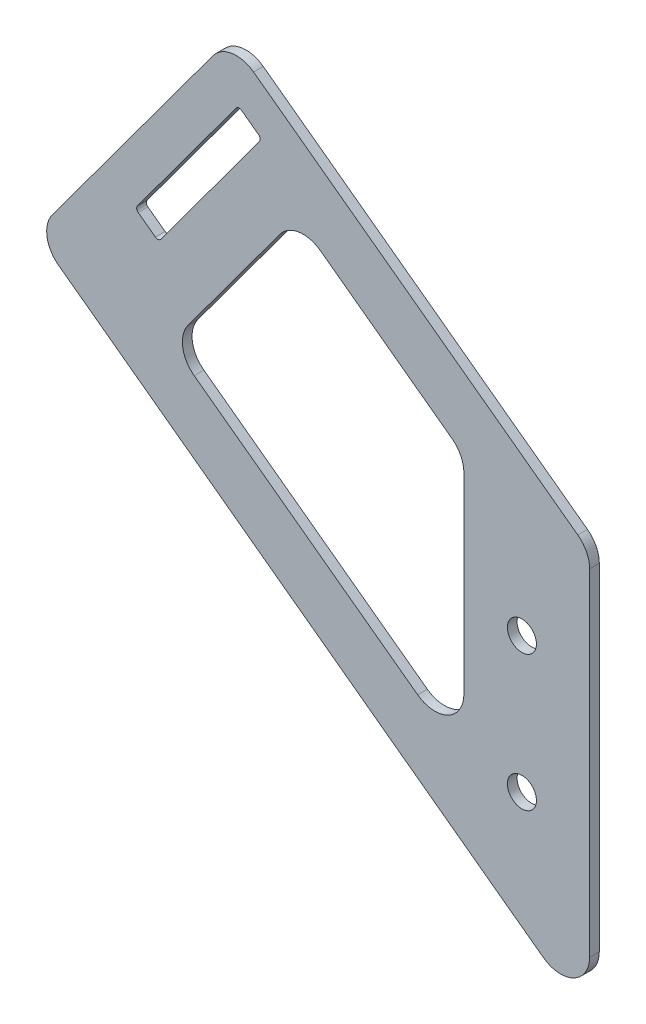
ISO-10303-21;
HEADER;
FILE_DESCRIPTION(('STEP AP214'),'2;1');
FILE_NAME('part.step','',(''),(''),'','','');
FILE_SCHEMA(('AUTOMOTIVE_DESIGN { 1 0 10303 214 1 1 1 1 }'));
ENDSEC;
DATA;
#1=APPLICATION_CONTEXT('core data for automotive mechanical design processes');
#2=APPLICATION_PROTOCOL_DEFINITION('international standard','automotive_design',2000,#1);
#3=PRODUCT_CONTEXT('',#1,'mechanical');
#4=PRODUCT('Part','Part','',(#3));
#5=PRODUCT_RELATED_PRODUCT_CATEGORY('part','',(#4));
#6=PRODUCT_DEFINITION_FORMATION('','',#4);
#7=PRODUCT_DEFINITION_CONTEXT('part definition',#1,'design');
#8=PRODUCT_DEFINITION('design','',#6,#7);
#9=PRODUCT_DEFINITION_SHAPE('','',#8);
#10=(LENGTH_UNIT() NAMED_UNIT(*) SI_UNIT(.MILLI.,.METRE.));
#11=(NAMED_UNIT(*) PLANE_ANGLE_UNIT() SI_UNIT($,.RADIAN.));
#12=(NAMED_UNIT(*) SI_UNIT($,.STERADIAN.) SOLID_ANGLE_UNIT());
#13=UNCERTAINTY_MEASURE_WITH_UNIT(LENGTH_MEASURE(1.E-05),#10,'distance_accuracy_value','');
#14=(GEOMETRIC_REPRESENTATION_CONTEXT(3) GLOBAL_UNCERTAINTY_ASSIGNED_CONTEXT((#13)) GLOBAL_UNIT_ASSIGNED_CONTEXT((#10,
#11,#12)) REPRESENTATION_CONTEXT('',''));
#15=CARTESIAN_POINT('',(0.,0.,0.));
#16=DIRECTION('',(0.,0.,1.));
#17=DIRECTION('',(1.,0.,0.));
#18=AXIS2_PLACEMENT_3D('',#15,#16,#17);
#19=CARTESIAN_POINT('',(136.403656021627,185.179026695265,3.175));
#20=DIRECTION('',(-0.593074905688188,-0.805147288539772,0.));
#21=DIRECTION('',(0.805147288539772,-0.593074905688188,0.));
#22=AXIS2_PLACEMENT_3D('',#19,#20,#21);
#23=PLANE('',#22);
#24=DIRECTION('',(-0.805147288539772,0.593074905688188,0.));
#25=VECTOR('',#24,1.);
#26=CARTESIAN_POINT('',(136.403656021627,185.179026695265,0.));
#27=LINE('',#26,#25);
#28=CARTESIAN_POINT('',(-155.846074694503,400.451417162125,0.));
#29=VERTEX_POINT('',#28);
#30=CARTESIAN_POINT('',(-161.470028504955,404.594045378358,0.));
#31=VERTEX_POINT('',#30);
#32=EDGE_CURVE('E224',#29,#31,#27,.T.);
#33=ORIENTED_EDGE('',*,*,#32,.T.);
#34=DIRECTION('',(0.,0.,-1.));
#35=VECTOR('',#34,1.);
#36=CARTESIAN_POINT('',(-161.470028504955,404.594045378358,3.175));
#37=LINE('',#36,#35);
#38=CARTESIAN_POINT('',(-161.470028504955,404.594045378358,3.175));
#39=VERTEX_POINT('',#38);
#40=EDGE_CURVE('E205',#39,#31,#37,.T.);
#41=ORIENTED_EDGE('',*,*,#40,.F.);
#42=DIRECTION('',(-0.805147288539772,0.593074905688188,0.));
#43=VECTOR('',#42,1.);
#44=CARTESIAN_POINT('',(136.403656021627,185.179026695265,3.175));
#45=LINE('',#44,#43);
#46=CARTESIAN_POINT('',(-155.846074694503,400.451417162125,3.175));
#47=VERTEX_POINT('',#46);
#48=EDGE_CURVE('E212',#47,#39,#45,.T.);
#49=ORIENTED_EDGE('',*,*,#48,.F.);
#50=DIRECTION('',(0.,0.,-1.));
#51=VECTOR('',#50,1.);
#52=CARTESIAN_POINT('',(-155.846074694503,400.451417162125,3.175));
#53=LINE('',#52,#51);
#54=EDGE_CURVE('E342',#47,#29,#53,.T.);
#55=ORIENTED_EDGE('',*,*,#54,.T.);
#56=EDGE_LOOP('',(#33,#41,#49,#55));
#57=FACE_BOUND('',#56,.T.);
#58=ADVANCED_FACE('F38',(#57),#23,.F.);
#59=CARTESIAN_POINT('',(-160.716823374731,405.616582434804,3.175));
#60=DIRECTION('',(0.,0.,-1.));
#61=DIRECTION('',(-1.,0.,0.));
#62=AXIS2_PLACEMENT_3D('',#59,#60,#61);
#63=CYLINDRICAL_SURFACE('',#62,1.27000000000001);
#64=CARTESIAN_POINT('',(-160.716823374731,405.616582434804,0.));
#65=DIRECTION('',(0.,0.,1.));
#66=DIRECTION('',(1.,0.,0.));
#67=AXIS2_PLACEMENT_3D('',#64,#65,#66);
#68=CIRCLE('',#67,1.27000000000001);
#69=CARTESIAN_POINT('',(-161.739360431176,406.369787565028,0.));
#70=VERTEX_POINT('',#69);
#71=EDGE_CURVE('E367',#31,#70,#68,.F.);
#72=ORIENTED_EDGE('',*,*,#71,.T.);
#73=DIRECTION('',(0.,0.,-1.));
#74=VECTOR('',#73,1.);
#75=CARTESIAN_POINT('',(-161.739360431176,406.369787565028,3.175));
#76=LINE('',#75,#74);
#77=CARTESIAN_POINT('',(-161.739360431176,406.369787565028,3.175));
#78=VERTEX_POINT('',#77);
#79=EDGE_CURVE('E207',#78,#70,#76,.T.);
#80=ORIENTED_EDGE('',*,*,#79,.F.);
#81=CARTESIAN_POINT('',(-160.716823374731,405.616582434804,3.175));
#82=DIRECTION('',(0.,0.,1.));
#83=DIRECTION('',(1.,0.,0.));
#84=AXIS2_PLACEMENT_3D('',#81,#82,#83);
#85=CIRCLE('',#84,1.27000000000001);
#86=EDGE_CURVE('E200',#39,#78,#85,.F.);
#87=ORIENTED_EDGE('',*,*,#86,.F.);
#88=ORIENTED_EDGE('',*,*,#40,.T.);
#89=EDGE_LOOP('',(#72,#80,#87,#88));
#90=FACE_BOUND('',#89,.T.);
#91=ADVANCED_FACE('F203',(#90),#63,.F.);
#92=CARTESIAN_POINT('',(-298.896221583027,220.168223813321,3.175));
#93=DIRECTION('',(0.805147288539767,-0.593074905688195,0.));
#94=DIRECTION('',(0.593074905688195,0.805147288539767,0.));
#95=AXIS2_PLACEMENT_3D('',#92,#93,#94);
#96=PLANE('',#95);
#97=DIRECTION('',(-0.593074905688195,-0.805147288539767,0.));
#98=VECTOR('',#97,1.);
#99=CARTESIAN_POINT('',(-298.896221583027,220.168223813321,0.));
#100=LINE('',#99,#98);
#101=CARTESIAN_POINT('',(-129.351539831544,450.338880992184,0.));
#102=VERTEX_POINT('',#101);
#103=EDGE_CURVE('E369',#102,#70,#100,.T.);
#104=ORIENTED_EDGE('',*,*,#103,.F.);
#105=DIRECTION('',(0.,0.,-1.));
#106=VECTOR('',#105,1.);
#107=CARTESIAN_POINT('',(-129.351539831544,450.338880992184,3.175));
#108=LINE('',#107,#106);
#109=CARTESIAN_POINT('',(-129.351539831544,450.338880992184,3.175));
#110=VERTEX_POINT('',#109);
#111=EDGE_CURVE('E229',#110,#102,#108,.T.);
#112=ORIENTED_EDGE('',*,*,#111,.F.);
#113=DIRECTION('',(-0.593074905688195,-0.805147288539767,0.));
#114=VECTOR('',#113,1.);
#115=CARTESIAN_POINT('',(-298.896221583027,220.168223813321,3.175));
#116=LINE('',#115,#114);
#117=EDGE_CURVE('E211',#110,#78,#116,.T.);
#118=ORIENTED_EDGE('',*,*,#117,.T.);
#119=ORIENTED_EDGE('',*,*,#79,.T.);
#120=EDGE_LOOP('',(#104,#112,#118,#119));
#121=FACE_BOUND('',#120,.T.);
#122=ADVANCED_FACE('F405',(#121),#96,.T.);
#123=CARTESIAN_POINT('',(-128.329002775098,449.58567586196,3.175));
#124=DIRECTION('',(0.,0.,-1.));
#125=DIRECTION('',(-1.,0.,0.));
#126=AXIS2_PLACEMENT_3D('',#123,#124,#125);
#127=CYLINDRICAL_SURFACE('',#126,1.27000000000003);
#128=CARTESIAN_POINT('',(-128.329002775098,449.58567586196,0.));
#129=DIRECTION('',(0.,0.,1.));
#130=DIRECTION('',(1.,0.,0.));
#131=AXIS2_PLACEMENT_3D('',#128,#129,#130);
#132=CIRCLE('',#131,1.27000000000003);
#133=CARTESIAN_POINT('',(-127.575797644874,450.608212918406,0.));
#134=VERTEX_POINT('',#133);
#135=EDGE_CURVE('E372',#102,#134,#132,.F.);
#136=ORIENTED_EDGE('',*,*,#135,.T.);
#137=DIRECTION('',(0.,0.,-1.));
#138=VECTOR('',#137,1.);
#139=CARTESIAN_POINT('',(-127.575797644874,450.608212918406,3.175));
#140=LINE('',#139,#138);
#141=CARTESIAN_POINT('',(-127.575797644874,450.608212918406,3.175));
#142=VERTEX_POINT('',#141);
#143=EDGE_CURVE('E395',#142,#134,#140,.T.);
#144=ORIENTED_EDGE('',*,*,#143,.F.);
#145=CARTESIAN_POINT('',(-128.329002775098,449.58567586196,3.175));
#146=DIRECTION('',(0.,0.,1.));
#147=DIRECTION('',(1.,0.,0.));
#148=AXIS2_PLACEMENT_3D('',#145,#146,#147);
#149=CIRCLE('',#148,1.27000000000003);
#150=EDGE_CURVE('E331',#110,#142,#149,.F.);
#151=ORIENTED_EDGE('',*,*,#150,.F.);
#152=ORIENTED_EDGE('',*,*,#111,.T.);
#153=EDGE_LOOP('',(#136,#144,#151,#152));
#154=FACE_BOUND('',#153,.T.);
#155=ADVANCED_FACE('F399',(#154),#127,.F.);
#156=CARTESIAN_POINT('',(170.297886881707,231.193194235311,3.175));
#157=DIRECTION('',(-0.593074905688191,-0.805147288539769,0.));
#158=DIRECTION('',(0.805147288539769,-0.593074905688191,0.));
#159=AXIS2_PLACEMENT_3D('',#156,#157,#158);
#160=PLANE('',#159);
#161=DIRECTION('',(-0.80514728853977,0.593074905688192,0.));
#162=VECTOR('',#161,1.);
#163=CARTESIAN_POINT('',(170.297886881707,231.193194235311,0.));
#164=LINE('',#163,#162);
#165=CARTESIAN_POINT('',(-121.951843834423,446.465584702173,0.));
#166=VERTEX_POINT('',#165);
#167=EDGE_CURVE('E375',#166,#134,#164,.T.);
#168=ORIENTED_EDGE('',*,*,#167,.F.);
#169=DIRECTION('',(0.,0.,-1.));
#170=VECTOR('',#169,1.);
#171=CARTESIAN_POINT('',(-121.951843834423,446.465584702173,3.175));
#172=LINE('',#171,#170);
#173=CARTESIAN_POINT('',(-121.951843834423,446.465584702173,3.175));
#174=VERTEX_POINT('',#173);
#175=EDGE_CURVE('E393',#174,#166,#172,.T.);
#176=ORIENTED_EDGE('',*,*,#175,.F.);
#177=DIRECTION('',(-0.80514728853977,0.593074905688192,0.));
#178=VECTOR('',#177,1.);
#179=CARTESIAN_POINT('',(170.297886881707,231.193194235311,3.175));
#180=LINE('',#179,#178);
#181=EDGE_CURVE('E333',#174,#142,#180,.T.);
#182=ORIENTED_EDGE('',*,*,#181,.T.);
#183=ORIENTED_EDGE('',*,*,#143,.T.);
#184=EDGE_LOOP('',(#168,#176,#182,#183));
#185=FACE_BOUND('',#184,.T.);
#186=ADVANCED_FACE('F415',(#185),#160,.T.);
#187=CARTESIAN_POINT('',(-122.705048964647,445.443047645728,3.175));
#188=DIRECTION('',(0.,0.,-1.));
#189=DIRECTION('',(-1.,0.,0.));
#190=AXIS2_PLACEMENT_3D('',#187,#188,#189);
#191=CYLINDRICAL_SURFACE('',#190,1.27000000000002);
#192=CARTESIAN_POINT('',(-122.705048964647,445.443047645728,0.));
#193=DIRECTION('',(0.,0.,1.));
#194=DIRECTION('',(1.,0.,0.));
#195=AXIS2_PLACEMENT_3D('',#192,#193,#194);
#196=CIRCLE('',#195,1.27000000000002);
#197=CARTESIAN_POINT('',(-121.682511908201,444.689842515503,0.));
#198=VERTEX_POINT('',#197);
#199=EDGE_CURVE('E378',#166,#198,#196,.F.);
#200=ORIENTED_EDGE('',*,*,#199,.T.);
#201=DIRECTION('',(0.,0.,-1.));
#202=VECTOR('',#201,1.);
#203=CARTESIAN_POINT('',(-121.682511908201,444.689842515503,3.175));
#204=LINE('',#203,#202);
#205=CARTESIAN_POINT('',(-121.682511908201,444.689842515503,3.175));
#206=VERTEX_POINT('',#205);
#207=EDGE_CURVE('E391',#206,#198,#204,.T.);
#208=ORIENTED_EDGE('',*,*,#207,.F.);
#209=CARTESIAN_POINT('',(-122.705048964647,445.443047645728,3.175));
#210=DIRECTION('',(0.,0.,1.));
#211=DIRECTION('',(1.,0.,0.));
#212=AXIS2_PLACEMENT_3D('',#209,#210,#211);
#213=CIRCLE('',#212,1.27000000000002);
#214=EDGE_CURVE('E336',#174,#206,#213,.F.);
#215=ORIENTED_EDGE('',*,*,#214,.F.);
#216=ORIENTED_EDGE('',*,*,#175,.T.);
#217=EDGE_LOOP('',(#200,#208,#215,#216));
#218=FACE_BOUND('',#217,.T.);
#219=ADVANCED_FACE('F418',(#218),#191,.F.);
#220=CARTESIAN_POINT('',(-291.227193659685,214.51918533664,3.175));
#221=DIRECTION('',(-0.805147288539766,0.593074905688196,0.));
#222=DIRECTION('',(-0.593074905688196,-0.805147288539766,0.));
#223=AXIS2_PLACEMENT_3D('',#220,#221,#222);
#224=PLANE('',#223);
#225=DIRECTION('',(0.593074905688196,0.805147288539766,0.));
#226=VECTOR('',#225,1.);
#227=CARTESIAN_POINT('',(-291.227193659685,214.51918533664,0.));
#228=LINE('',#227,#226);
#229=CARTESIAN_POINT('',(-154.070332507834,400.720749088347,0.));
#230=VERTEX_POINT('',#229);
#231=EDGE_CURVE('E381',#230,#198,#228,.T.);
#232=ORIENTED_EDGE('',*,*,#231,.F.);
#233=DIRECTION('',(0.,0.,-1.));
#234=VECTOR('',#233,1.);
#235=CARTESIAN_POINT('',(-154.070332507834,400.720749088347,3.175));
#236=LINE('',#235,#234);
#237=CARTESIAN_POINT('',(-154.070332507834,400.720749088347,3.175));
#238=VERTEX_POINT('',#237);
#239=EDGE_CURVE('E389',#238,#230,#236,.T.);
#240=ORIENTED_EDGE('',*,*,#239,.F.);
#241=DIRECTION('',(0.593074905688196,0.805147288539766,0.));
#242=VECTOR('',#241,1.);
#243=CARTESIAN_POINT('',(-291.227193659685,214.51918533664,3.175));
#244=LINE('',#243,#242);
#245=EDGE_CURVE('E338',#238,#206,#244,.T.);
#246=ORIENTED_EDGE('',*,*,#245,.T.);
#247=ORIENTED_EDGE('',*,*,#207,.T.);
#248=EDGE_LOOP('',(#232,#240,#246,#247));
#249=FACE_BOUND('',#248,.T.);
#250=ADVANCED_FACE('F411',(#249),#224,.T.);
#251=CARTESIAN_POINT('',(-54.6100000000139,0.,3.175));
#252=DIRECTION('',(1.,0.,0.));
#253=DIRECTION('',(0.,1.,0.));
#254=AXIS2_PLACEMENT_3D('',#251,#252,#253);
#255=PLANE('',#254);
#256=DIRECTION('',(0.,-1.,0.));
#257=VECTOR('',#256,1.);
#258=CARTESIAN_POINT('',(-54.6100000000139,0.,0.));
#259=LINE('',#258,#257);
#260=CARTESIAN_POINT('',(-54.6100000000139,384.160563101391,0.));
#261=VERTEX_POINT('',#260);
#262=CARTESIAN_POINT('',(-54.6100000000139,321.066517175791,0.));
#263=VERTEX_POINT('',#262);
#264=EDGE_CURVE('E360',#261,#263,#259,.T.);
#265=ORIENTED_EDGE('',*,*,#264,.T.);
#266=DIRECTION('',(0.,0.,-1.));
#267=VECTOR('',#266,1.);
#268=CARTESIAN_POINT('',(-54.6100000000139,321.066517175791,3.175));
#269=LINE('',#268,#267);
#270=CARTESIAN_POINT('',(-54.6100000000139,321.066517175791,3.175));
#271=VERTEX_POINT('',#270);
#272=EDGE_CURVE('E243',#263,#271,#269,.F.);
#273=ORIENTED_EDGE('',*,*,#272,.T.);
#274=DIRECTION('',(0.,-1.,0.));
#275=VECTOR('',#274,1.);
#276=CARTESIAN_POINT('',(-54.6100000000139,0.,3.175));
#277=LINE('',#276,#275);
#278=CARTESIAN_POINT('',(-54.6100000000139,384.160563101391,3.175));
#279=VERTEX_POINT('',#278);
#280=EDGE_CURVE('E519',#279,#271,#277,.T.);
#281=ORIENTED_EDGE('',*,*,#280,.F.);
#282=DIRECTION('',(0.,0.,-1.));
#283=VECTOR('',#282,1.);
#284=CARTESIAN_POINT('',(-54.6100000000139,384.160563101391,0.));
#285=LINE('',#284,#283);
#286=EDGE_CURVE('E240',#279,#261,#285,.T.);
#287=ORIENTED_EDGE('',*,*,#286,.T.);
#288=EDGE_LOOP('',(#265,#273,#281,#287));
#289=FACE_BOUND('',#288,.T.);
#290=ADVANCED_FACE('F425',(#289),#255,.F.);
#291=CARTESIAN_POINT('',(125.105579068267,169.840970848579,3.175));
#292=DIRECTION('',(-0.593074905688196,-0.805147288539766,0.));
#293=DIRECTION('',(0.805147288539766,-0.593074905688196,0.));
#294=AXIS2_PLACEMENT_3D('',#291,#292,#293);
#295=PLANE('',#294);
#296=DIRECTION('',(-0.805147288539766,0.593074905688196,0.));
#297=VECTOR('',#296,1.);
#298=CARTESIAN_POINT('',(125.105579068267,169.840970848579,0.));
#299=LINE('',#298,#297);
#300=CARTESIAN_POINT('',(-69.784038476694,313.39748925245,0.));
#301=VERTEX_POINT('',#300);
#302=CARTESIAN_POINT('',(-143.114530821394,367.413040755179,0.));
#303=VERTEX_POINT('',#302);
#304=EDGE_CURVE('E313',#301,#303,#299,.T.);
#305=ORIENTED_EDGE('',*,*,#304,.T.);
#306=DIRECTION('',(0.,0.,-1.));
#307=VECTOR('',#306,1.);
#308=CARTESIAN_POINT('',(-143.114530821394,367.413040755179,3.175));
#309=LINE('',#308,#307);
#310=CARTESIAN_POINT('',(-143.114530821394,367.413040755179,3.175));
#311=VERTEX_POINT('',#310);
#312=EDGE_CURVE('E238',#303,#311,#309,.F.);
#313=ORIENTED_EDGE('',*,*,#312,.T.);
#314=DIRECTION('',(-0.805147288539766,0.593074905688196,0.));
#315=VECTOR('',#314,1.);
#316=CARTESIAN_POINT('',(125.105579068267,169.840970848579,3.175));
#317=LINE('',#316,#315);
#318=CARTESIAN_POINT('',(-69.784038476694,313.39748925245,3.175));
#319=VERTEX_POINT('',#318);
#320=EDGE_CURVE('E326',#319,#311,#317,.T.);
#321=ORIENTED_EDGE('',*,*,#320,.F.);
#322=DIRECTION('',(0.,0.,-1.));
#323=VECTOR('',#322,1.);
#324=CARTESIAN_POINT('',(-69.784038476694,313.39748925245,0.));
#325=LINE('',#324,#323);
#326=EDGE_CURVE('E235',#319,#301,#325,.T.);
#327=ORIENTED_EDGE('',*,*,#326,.T.);
#328=EDGE_LOOP('',(#305,#313,#321,#327));
#329=FACE_BOUND('',#328,.T.);
#330=ADVANCED_FACE('F443',(#329),#295,.F.);
#331=CARTESIAN_POINT('',(-275.889137813002,203.22110838328,3.175));
#332=DIRECTION('',(0.805147288539766,-0.593074905688195,0.));
#333=DIRECTION('',(0.593074905688196,0.805147288539767,0.));
#334=AXIS2_PLACEMENT_3D('',#331,#332,#333);
#335=PLANE('',#334);
#336=DIRECTION('',(-0.593074905688196,-0.805147288539767,0.));
#337=VECTOR('',#336,1.);
#338=CARTESIAN_POINT('',(-275.889137813002,203.22110838328,3.175));
#339=LINE('',#338,#337);
#340=CARTESIAN_POINT('',(-115.006315059095,421.63258941302,3.175));
#341=VERTEX_POINT('',#340);
#342=CARTESIAN_POINT('',(-145.134520268055,380.7311071552,3.175));
#343=VERTEX_POINT('',#342);
#344=EDGE_CURVE('E321',#341,#343,#339,.T.);
#345=ORIENTED_EDGE('',*,*,#344,.T.);
#346=DIRECTION('',(0.,0.,-1.));
#347=VECTOR('',#346,1.);
#348=CARTESIAN_POINT('',(-145.134520268055,380.7311071552,3.175));
#349=LINE('',#348,#347);
#350=CARTESIAN_POINT('',(-145.134520268055,380.7311071552,0.));
#351=VERTEX_POINT('',#350);
#352=EDGE_CURVE('E227',#343,#351,#349,.T.);
#353=ORIENTED_EDGE('',*,*,#352,.T.);
#354=DIRECTION('',(-0.593074905688196,-0.805147288539767,0.));
#355=VECTOR('',#354,1.);
#356=CARTESIAN_POINT('',(-275.889137813002,203.22110838328,0.));
#357=LINE('',#356,#355);
#358=CARTESIAN_POINT('',(-115.006315059095,421.63258941302,0.));
#359=VERTEX_POINT('',#358);
#360=EDGE_CURVE('E302',#359,#351,#357,.T.);
#361=ORIENTED_EDGE('',*,*,#360,.F.);
#362=DIRECTION('',(0.,0.,-1.));
#363=VECTOR('',#362,1.);
#364=CARTESIAN_POINT('',(-115.006315059095,421.63258941302,3.175));
#365=LINE('',#364,#363);
#366=EDGE_CURVE('E225',#359,#341,#365,.F.);
#367=ORIENTED_EDGE('',*,*,#366,.T.);
#368=EDGE_LOOP('',(#345,#353,#361,#367));
#369=FACE_BOUND('',#368,.T.);
#370=ADVANCED_FACE('F310',(#369),#335,.T.);
#371=CARTESIAN_POINT('',(-309.121592147482,227.700275115561,3.175));
#372=DIRECTION('',(0.805147288539767,-0.593074905688195,0.));
#373=DIRECTION('',(0.593074905688195,0.805147288539767,0.));
#374=AXIS2_PLACEMENT_3D('',#371,#372,#373);
#375=PLANE('',#374);
#376=DIRECTION('',(-0.593074905688195,-0.805147288539767,0.));
#377=VECTOR('',#376,1.);
#378=CARTESIAN_POINT('',(-309.121592147482,227.700275115561,3.175));
#379=LINE('',#378,#377);
#380=CARTESIAN_POINT('',(-136.940692440215,461.449811991984,3.175));
#381=VERTEX_POINT('',#380);
#382=CARTESIAN_POINT('',(-189.665051555895,389.872218040798,3.175));
#383=VERTEX_POINT('',#382);
#384=EDGE_CURVE('E503',#381,#383,#379,.T.);
#385=ORIENTED_EDGE('',*,*,#384,.F.);
#386=DIRECTION('',(0.,0.,-1.));
#387=VECTOR('',#386,1.);
#388=CARTESIAN_POINT('',(-136.940692440215,461.449811991984,3.175));
#389=LINE('',#388,#387);
#390=CARTESIAN_POINT('',(-136.940692440215,461.449811991984,0.));
#391=VERTEX_POINT('',#390);
#392=EDGE_CURVE('E281',#381,#391,#389,.T.);
#393=ORIENTED_EDGE('',*,*,#392,.T.);
#394=DIRECTION('',(-0.593074905688195,-0.805147288539767,0.));
#395=VECTOR('',#394,1.);
#396=CARTESIAN_POINT('',(-309.121592147482,227.700275115561,0.));
#397=LINE('',#396,#395);
#398=CARTESIAN_POINT('',(-189.665051555895,389.872218040798,0.));
#399=VERTEX_POINT('',#398);
#400=EDGE_CURVE('E349',#391,#399,#397,.T.);
#401=ORIENTED_EDGE('',*,*,#400,.T.);
#402=DIRECTION('',(0.,0.,-1.));
#403=VECTOR('',#402,1.);
#404=CARTESIAN_POINT('',(-189.665051555895,389.872218040798,3.175));
#405=LINE('',#404,#403);
#406=EDGE_CURVE('E279',#399,#383,#405,.F.);
#407=ORIENTED_EDGE('',*,*,#406,.T.);
#408=EDGE_LOOP('',(#385,#393,#401,#407));
#409=FACE_BOUND('',#408,.T.);
#410=ADVANCED_FACE('F442',(#409),#375,.F.);
#411=CARTESIAN_POINT('',(113.807502114907,154.502915001896,3.175));
#412=DIRECTION('',(0.593074905688195,0.805147288539767,0.));
#413=DIRECTION('',(-0.805147288539767,0.593074905688195,0.));
#414=AXIS2_PLACEMENT_3D('',#411,#412,#413);
#415=PLANE('',#414);
#416=DIRECTION('',(0.805147288539767,-0.593074905688195,0.));
#417=VECTOR('',#416,1.);
#418=CARTESIAN_POINT('',(113.807502114907,154.502915001896,0.));
#419=LINE('',#418,#417);
#420=CARTESIAN_POINT('',(-187.645062109234,376.554151640777,0.));
#421=VERTEX_POINT('',#420);
#422=CARTESIAN_POINT('',(-28.5090384766937,259.333882069191,0.));
#423=VERTEX_POINT('',#422);
#424=EDGE_CURVE('E352',#421,#423,#419,.T.);
#425=ORIENTED_EDGE('',*,*,#424,.T.);
#426=DIRECTION('',(0.,0.,-1.));
#427=VECTOR('',#426,1.);
#428=CARTESIAN_POINT('',(-28.5090384766937,259.333882069191,3.175));
#429=LINE('',#428,#427);
#430=CARTESIAN_POINT('',(-28.5090384766937,259.333882069191,3.175));
#431=VERTEX_POINT('',#430);
#432=EDGE_CURVE('E266',#423,#431,#429,.F.);
#433=ORIENTED_EDGE('',*,*,#432,.T.);
#434=DIRECTION('',(0.805147288539767,-0.593074905688195,0.));
#435=VECTOR('',#434,1.);
#436=CARTESIAN_POINT('',(113.807502114907,154.502915001896,3.175));
#437=LINE('',#436,#435);
#438=CARTESIAN_POINT('',(-187.645062109234,376.554151640777,3.175));
#439=VERTEX_POINT('',#438);
#440=EDGE_CURVE('E508',#439,#431,#437,.T.);
#441=ORIENTED_EDGE('',*,*,#440,.F.);
#442=DIRECTION('',(0.,0.,-1.));
#443=VECTOR('',#442,1.);
#444=CARTESIAN_POINT('',(-187.645062109234,376.554151640777,3.175));
#445=LINE('',#444,#443);
#446=EDGE_CURVE('E263',#439,#421,#445,.T.);
#447=ORIENTED_EDGE('',*,*,#446,.T.);
#448=EDGE_LOOP('',(#425,#433,#441,#447));
#449=FACE_BOUND('',#448,.T.);
#450=ADVANCED_FACE('F455',(#449),#415,.F.);
#451=CARTESIAN_POINT('',(-13.3350000000136,0.,3.175));
#452=DIRECTION('',(-1.,0.,0.));
#453=DIRECTION('',(0.,0.,1.));
#454=AXIS2_PLACEMENT_3D('',#451,#452,#453);
#455=PLANE('',#454);
#456=DIRECTION('',(0.,1.,0.));
#457=VECTOR('',#456,1.);
#458=CARTESIAN_POINT('',(-13.3350000000136,0.,3.175));
#459=LINE('',#458,#457);
#460=CARTESIAN_POINT('',(-13.3350000000136,267.002909992532,3.175));
#461=VERTEX_POINT('',#460);
#462=CARTESIAN_POINT('',(-13.3350000000136,377.417490362331,3.175));
#463=VERTEX_POINT('',#462);
#464=EDGE_CURVE('E511',#461,#463,#459,.T.);
#465=ORIENTED_EDGE('',*,*,#464,.F.);
#466=DIRECTION('',(0.,0.,-1.));
#467=VECTOR('',#466,1.);
#468=CARTESIAN_POINT('',(-13.3350000000136,267.002909992532,3.175));
#469=LINE('',#468,#467);
#470=CARTESIAN_POINT('',(-13.3350000000136,267.002909992532,0.));
#471=VERTEX_POINT('',#470);
#472=EDGE_CURVE('E252',#461,#471,#469,.T.);
#473=ORIENTED_EDGE('',*,*,#472,.T.);
#474=DIRECTION('',(0.,1.,0.));
#475=VECTOR('',#474,1.);
#476=CARTESIAN_POINT('',(-13.3350000000136,0.,0.));
#477=LINE('',#476,#475);
#478=CARTESIAN_POINT('',(-13.3350000000136,377.417490362331,0.));
#479=VERTEX_POINT('',#478);
#480=EDGE_CURVE('E355',#471,#479,#477,.T.);
#481=ORIENTED_EDGE('',*,*,#480,.T.);
#482=DIRECTION('',(0.,0.,-1.));
#483=VECTOR('',#482,1.);
#484=CARTESIAN_POINT('',(-13.3350000000136,377.417490362331,3.175));
#485=LINE('',#484,#483);
#486=EDGE_CURVE('E250',#479,#463,#485,.F.);
#487=ORIENTED_EDGE('',*,*,#486,.T.);
#488=EDGE_LOOP('',(#465,#473,#481,#487));
#489=FACE_BOUND('',#488,.T.);
#490=ADVANCED_FACE('F439',(#489),#455,.F.);
#491=CARTESIAN_POINT('',(166.531861230587,226.080508953081,3.175));
#492=DIRECTION('',(0.593074905688196,0.805147288539766,0.));
#493=DIRECTION('',(-0.805147288539766,0.593074905688196,0.));
#494=AXIS2_PLACEMENT_3D('',#491,#492,#493);
#495=PLANE('',#494);
#496=DIRECTION('',(0.805147288539766,-0.593074905688196,0.));
#497=VECTOR('',#496,1.);
#498=CARTESIAN_POINT('',(166.531861230587,226.080508953081,0.));
#499=LINE('',#498,#497);
#500=CARTESIAN_POINT('',(-101.688248659074,423.652578859681,0.));
#501=VERTEX_POINT('',#500);
#502=CARTESIAN_POINT('',(-58.4859615233339,391.829591024732,0.));
#503=VERTEX_POINT('',#502);
#504=EDGE_CURVE('E304',#501,#503,#499,.T.);
#505=ORIENTED_EDGE('',*,*,#504,.T.);
#506=DIRECTION('',(0.,0.,-1.));
#507=VECTOR('',#506,1.);
#508=CARTESIAN_POINT('',(-58.4859615233339,391.829591024732,3.175));
#509=LINE('',#508,#507);
#510=CARTESIAN_POINT('',(-58.4859615233339,391.829591024732,3.175));
#511=VERTEX_POINT('',#510);
#512=EDGE_CURVE('E248',#503,#511,#509,.F.);
#513=ORIENTED_EDGE('',*,*,#512,.T.);
#514=DIRECTION('',(0.805147288539766,-0.593074905688196,0.));
#515=VECTOR('',#514,1.);
#516=CARTESIAN_POINT('',(166.531861230587,226.080508953081,3.175));
#517=LINE('',#516,#515);
#518=CARTESIAN_POINT('',(-101.688248659074,423.652578859681,3.175));
#519=VERTEX_POINT('',#518);
#520=EDGE_CURVE('E221',#519,#511,#517,.T.);
#521=ORIENTED_EDGE('',*,*,#520,.F.);
#522=DIRECTION('',(0.,0.,-1.));
#523=VECTOR('',#522,1.);
#524=CARTESIAN_POINT('',(-101.688248659074,423.652578859681,3.175));
#525=LINE('',#524,#523);
#526=EDGE_CURVE('E245',#519,#501,#525,.T.);
#527=ORIENTED_EDGE('',*,*,#526,.T.);
#528=EDGE_LOOP('',(#505,#513,#521,#527));
#529=FACE_BOUND('',#528,.T.);
#530=ADVANCED_FACE('F323',(#529),#495,.F.);
#531=CARTESIAN_POINT('',(177.829938183947,241.418564799764,3.175));
#532=DIRECTION('',(-0.593074905688196,-0.805147288539766,0.));
#533=DIRECTION('',(0.805147288539767,-0.593074905688196,0.));
#534=AXIS2_PLACEMENT_3D('',#531,#532,#533);
#535=PLANE('',#534);
#536=DIRECTION('',(-0.805147288539766,0.593074905688196,0.));
#537=VECTOR('',#536,1.);
#538=CARTESIAN_POINT('',(177.829938183947,241.418564799764,3.175));
#539=LINE('',#538,#537);
#540=CARTESIAN_POINT('',(-17.2109615233336,385.086518285673,3.175));
#541=VERTEX_POINT('',#540);
#542=CARTESIAN_POINT('',(-123.622626040193,463.469801438645,3.175));
#543=VERTEX_POINT('',#542);
#544=EDGE_CURVE('E505',#541,#543,#539,.T.);
#545=ORIENTED_EDGE('',*,*,#544,.F.);
#546=DIRECTION('',(0.,0.,-1.));
#547=VECTOR('',#546,1.);
#548=CARTESIAN_POINT('',(-17.2109615233336,385.086518285673,3.175));
#549=LINE('',#548,#547);
#550=CARTESIAN_POINT('',(-17.2109615233336,385.086518285673,0.));
#551=VERTEX_POINT('',#550);
#552=EDGE_CURVE('E276',#541,#551,#549,.T.);
#553=ORIENTED_EDGE('',*,*,#552,.T.);
#554=DIRECTION('',(-0.805147288539766,0.593074905688196,0.));
#555=VECTOR('',#554,1.);
#556=CARTESIAN_POINT('',(177.829938183947,241.418564799764,0.));
#557=LINE('',#556,#555);
#558=CARTESIAN_POINT('',(-123.622626040193,463.469801438645,0.));
#559=VERTEX_POINT('',#558);
#560=EDGE_CURVE('E358',#551,#559,#557,.T.);
#561=ORIENTED_EDGE('',*,*,#560,.T.);
#562=DIRECTION('',(0.,0.,-1.));
#563=VECTOR('',#562,1.);
#564=CARTESIAN_POINT('',(-123.622626040193,463.469801438645,3.175));
#565=LINE('',#564,#563);
#566=EDGE_CURVE('E53',#559,#543,#565,.F.);
#567=ORIENTED_EDGE('',*,*,#566,.T.);
#568=EDGE_LOOP('',(#545,#553,#561,#567));
#569=FACE_BOUND('',#568,.T.);
#570=ADVANCED_FACE('F438',(#569),#535,.F.);
#571=CARTESIAN_POINT('',(-35.5600000000141,302.837639338074,3.175));
#572=DIRECTION('',(0.,0.,-1.));
#573=DIRECTION('',(-1.,0.,0.));
#574=AXIS2_PLACEMENT_3D('',#571,#572,#573);
#575=CYLINDRICAL_SURFACE('',#574,4.7625000000168);
#576=CARTESIAN_POINT('',(-35.5600000000141,302.837639338074,3.175));
#577=DIRECTION('',(0.,0.,1.));
#578=DIRECTION('',(1.,0.,0.));
#579=AXIS2_PLACEMENT_3D('',#576,#577,#578);
#580=CIRCLE('',#579,4.7625000000168);
#581=CARTESIAN_POINT('',(-30.7974999999973,302.837639338074,3.175));
#582=VERTEX_POINT('',#581);
#583=EDGE_CURVE('E509',#582,#582,#580,.T.);
#584=ORIENTED_EDGE('',*,*,#583,.T.);
#585=EDGE_LOOP('',(#584));
#586=FACE_BOUND('',#585,.T.);
#587=CARTESIAN_POINT('',(-35.5600000000141,302.837639338074,0.));
#588=DIRECTION('',(0.,0.,1.));
#589=DIRECTION('',(1.,0.,0.));
#590=AXIS2_PLACEMENT_3D('',#587,#588,#589);
#591=CIRCLE('',#590,4.7625000000168);
#592=CARTESIAN_POINT('',(-30.7974999999973,302.837639338074,0.));
#593=VERTEX_POINT('',#592);
#594=EDGE_CURVE('E346',#593,#593,#591,.T.);
#595=ORIENTED_EDGE('',*,*,#594,.F.);
#596=EDGE_LOOP('',(#595));
#597=FACE_BOUND('',#596,.T.);
#598=ADVANCED_FACE('F452',(#586,#597),#575,.F.);
#599=CARTESIAN_POINT('',(-35.5600000000139,347.287639338074,3.175));
#600=DIRECTION('',(0.,0.,-1.));
#601=DIRECTION('',(-1.,0.,0.));
#602=AXIS2_PLACEMENT_3D('',#599,#600,#601);
#603=CYLINDRICAL_SURFACE('',#602,4.76250000001677);
#604=CARTESIAN_POINT('',(-35.5600000000139,347.287639338074,3.175));
#605=DIRECTION('',(0.,0.,1.));
#606=DIRECTION('',(1.,0.,0.));
#607=AXIS2_PLACEMENT_3D('',#604,#605,#606);
#608=CIRCLE('',#607,4.76250000001677);
#609=CARTESIAN_POINT('',(-30.7974999999972,347.287639338074,3.175));
#610=VERTEX_POINT('',#609);
#611=EDGE_CURVE('E387',#610,#610,#608,.T.);
#612=ORIENTED_EDGE('',*,*,#611,.T.);
#613=EDGE_LOOP('',(#612));
#614=FACE_BOUND('',#613,.T.);
#615=CARTESIAN_POINT('',(-35.5600000000139,347.287639338074,0.));
#616=DIRECTION('',(0.,0.,1.));
#617=DIRECTION('',(1.,0.,0.));
#618=AXIS2_PLACEMENT_3D('',#615,#616,#617);
#619=CIRCLE('',#618,4.76250000001677);
#620=CARTESIAN_POINT('',(-30.7974999999972,347.287639338074,0.));
#621=VERTEX_POINT('',#620);
#622=EDGE_CURVE('E343',#621,#621,#619,.T.);
#623=ORIENTED_EDGE('',*,*,#622,.F.);
#624=EDGE_LOOP('',(#623));
#625=FACE_BOUND('',#624,.T.);
#626=ADVANCED_FACE('F465',(#614,#625),#603,.F.);
#627=CARTESIAN_POINT('',(-155.092869564279,401.473954218571,3.175));
#628=DIRECTION('',(0.,0.,-1.));
#629=DIRECTION('',(-1.,0.,0.));
#630=AXIS2_PLACEMENT_3D('',#627,#628,#629);
#631=CYLINDRICAL_SURFACE('',#630,1.26999999999998);
#632=CARTESIAN_POINT('',(-155.092869564279,401.473954218571,0.));
#633=DIRECTION('',(0.,0.,1.));
#634=DIRECTION('',(1.,0.,0.));
#635=AXIS2_PLACEMENT_3D('',#632,#633,#634);
#636=CIRCLE('',#635,1.26999999999998);
#637=EDGE_CURVE('E384',#29,#230,#636,.T.);
#638=ORIENTED_EDGE('',*,*,#637,.F.);
#639=ORIENTED_EDGE('',*,*,#54,.F.);
#640=CARTESIAN_POINT('',(-155.092869564279,401.473954218571,3.175));
#641=DIRECTION('',(0.,0.,1.));
#642=DIRECTION('',(1.,0.,0.));
#643=AXIS2_PLACEMENT_3D('',#640,#641,#642);
#644=CIRCLE('',#643,1.26999999999998);
#645=EDGE_CURVE('E219',#47,#238,#644,.T.);
#646=ORIENTED_EDGE('',*,*,#645,.T.);
#647=ORIENTED_EDGE('',*,*,#239,.T.);
#648=EDGE_LOOP('',(#638,#639,#646,#647));
#649=FACE_BOUND('',#648,.T.);
#650=ADVANCED_FACE('F408',(#649),#631,.F.);
#651=CARTESIAN_POINT('',(0.,0.,3.175));
#652=DIRECTION('',(0.,0.,1.));
#653=DIRECTION('',(1.,0.,0.));
#654=AXIS2_PLACEMENT_3D('',#651,#652,#653);
#655=PLANE('',#654);
#656=ORIENTED_EDGE('',*,*,#611,.F.);
#657=EDGE_LOOP('',(#656));
#658=FACE_BOUND('',#657,.T.);
#659=ORIENTED_EDGE('',*,*,#583,.F.);
#660=EDGE_LOOP('',(#659));
#661=FACE_BOUND('',#660,.T.);
#662=ORIENTED_EDGE('',*,*,#440,.T.);
#663=CARTESIAN_POINT('',(-22.8600000000136,267.002909992532,3.175));
#664=DIRECTION('',(0.,0.,1.));
#665=DIRECTION('',(1.,0.,0.));
#666=AXIS2_PLACEMENT_3D('',#663,#664,#665);
#667=CIRCLE('',#666,9.525);
#668=EDGE_CURVE('E273',#431,#461,#667,.T.);
#669=ORIENTED_EDGE('',*,*,#668,.T.);
#670=ORIENTED_EDGE('',*,*,#464,.T.);
#671=CARTESIAN_POINT('',(-22.8600000000136,377.417490362331,3.175));
#672=DIRECTION('',(0.,0.,1.));
#673=DIRECTION('',(1.,0.,0.));
#674=AXIS2_PLACEMENT_3D('',#671,#672,#673);
#675=CIRCLE('',#674,9.525);
#676=EDGE_CURVE('E60',#463,#541,#675,.T.);
#677=ORIENTED_EDGE('',*,*,#676,.T.);
#678=ORIENTED_EDGE('',*,*,#544,.T.);
#679=CARTESIAN_POINT('',(-129.271664516873,455.800773515304,3.175));
#680=DIRECTION('',(0.,0.,1.));
#681=DIRECTION('',(1.,0.,0.));
#682=AXIS2_PLACEMENT_3D('',#679,#680,#681);
#683=CIRCLE('',#682,9.525);
#684=EDGE_CURVE('E270',#543,#381,#683,.T.);
#685=ORIENTED_EDGE('',*,*,#684,.T.);
#686=ORIENTED_EDGE('',*,*,#384,.T.);
#687=CARTESIAN_POINT('',(-181.996023632554,384.223179564118,3.175));
#688=DIRECTION('',(0.,0.,1.));
#689=DIRECTION('',(1.,0.,0.));
#690=AXIS2_PLACEMENT_3D('',#687,#688,#689);
#691=CIRCLE('',#690,9.525);
#692=EDGE_CURVE('E268',#383,#439,#691,.T.);
#693=ORIENTED_EDGE('',*,*,#692,.T.);
#694=EDGE_LOOP('',(#662,#669,#670,#677,#678,#685,#686,#693));
#695=FACE_BOUND('',#694,.T.);
#696=ORIENTED_EDGE('',*,*,#520,.T.);
#697=CARTESIAN_POINT('',(-64.1350000000139,384.160563101391,3.175));
#698=DIRECTION('',(0.,0.,1.));
#699=DIRECTION('',(1.,0.,0.));
#700=AXIS2_PLACEMENT_3D('',#697,#698,#699);
#701=CIRCLE('',#700,9.525);
#702=EDGE_CURVE('E294',#511,#279,#701,.F.);
#703=ORIENTED_EDGE('',*,*,#702,.T.);
#704=ORIENTED_EDGE('',*,*,#280,.T.);
#705=CARTESIAN_POINT('',(-64.1350000000139,321.066517175791,3.175));
#706=DIRECTION('',(0.,0.,1.));
#707=DIRECTION('',(1.,0.,0.));
#708=AXIS2_PLACEMENT_3D('',#705,#706,#707);
#709=CIRCLE('',#708,9.525);
#710=EDGE_CURVE('E290',#271,#319,#709,.F.);
#711=ORIENTED_EDGE('',*,*,#710,.T.);
#712=ORIENTED_EDGE('',*,*,#320,.T.);
#713=CARTESIAN_POINT('',(-137.465492344714,375.08206867852,3.175));
#714=DIRECTION('',(0.,0.,1.));
#715=DIRECTION('',(1.,0.,0.));
#716=AXIS2_PLACEMENT_3D('',#713,#714,#715);
#717=CIRCLE('',#716,9.525);
#718=EDGE_CURVE('E286',#311,#343,#717,.F.);
#719=ORIENTED_EDGE('',*,*,#718,.T.);
#720=ORIENTED_EDGE('',*,*,#344,.F.);
#721=CARTESIAN_POINT('',(-107.337287135754,415.98355093634,3.175));
#722=DIRECTION('',(0.,0.,1.));
#723=DIRECTION('',(1.,0.,0.));
#724=AXIS2_PLACEMENT_3D('',#721,#722,#723);
#725=CIRCLE('',#724,9.525);
#726=EDGE_CURVE('E11',#341,#519,#725,.F.);
#727=ORIENTED_EDGE('',*,*,#726,.T.);
#728=EDGE_LOOP('',(#696,#703,#704,#711,#712,#719,#720,#727));
#729=FACE_BOUND('',#728,.T.);
#730=ORIENTED_EDGE('',*,*,#48,.T.);
#731=ORIENTED_EDGE('',*,*,#86,.T.);
#732=ORIENTED_EDGE('',*,*,#117,.F.);
#733=ORIENTED_EDGE('',*,*,#150,.T.);
#734=ORIENTED_EDGE('',*,*,#181,.F.);
#735=ORIENTED_EDGE('',*,*,#214,.T.);
#736=ORIENTED_EDGE('',*,*,#245,.F.);
#737=ORIENTED_EDGE('',*,*,#645,.F.);
#738=EDGE_LOOP('',(#730,#731,#732,#733,#734,#735,#736,#737));
#739=FACE_BOUND('',#738,.T.);
#740=ADVANCED_FACE('F216',(#658,#661,#695,#729,#739),#655,.T.);
#741=CARTESIAN_POINT('',(0.,0.,0.));
#742=DIRECTION('',(0.,0.,1.));
#743=DIRECTION('',(1.,0.,0.));
#744=AXIS2_PLACEMENT_3D('',#741,#742,#743);
#745=PLANE('',#744);
#746=ORIENTED_EDGE('',*,*,#622,.T.);
#747=EDGE_LOOP('',(#746));
#748=FACE_BOUND('',#747,.T.);
#749=ORIENTED_EDGE('',*,*,#594,.T.);
#750=EDGE_LOOP('',(#749));
#751=FACE_BOUND('',#750,.T.);
#752=ORIENTED_EDGE('',*,*,#480,.F.);
#753=CARTESIAN_POINT('',(-22.8600000000136,267.002909992532,0.));
#754=DIRECTION('',(0.,0.,1.));
#755=DIRECTION('',(1.,0.,0.));
#756=AXIS2_PLACEMENT_3D('',#753,#754,#755);
#757=CIRCLE('',#756,9.525);
#758=EDGE_CURVE('E261',#471,#423,#757,.F.);
#759=ORIENTED_EDGE('',*,*,#758,.T.);
#760=ORIENTED_EDGE('',*,*,#424,.F.);
#761=CARTESIAN_POINT('',(-181.996023632554,384.223179564118,0.));
#762=DIRECTION('',(0.,0.,1.));
#763=DIRECTION('',(1.,0.,0.));
#764=AXIS2_PLACEMENT_3D('',#761,#762,#763);
#765=CIRCLE('',#764,9.525);
#766=EDGE_CURVE('E255',#421,#399,#765,.F.);
#767=ORIENTED_EDGE('',*,*,#766,.T.);
#768=ORIENTED_EDGE('',*,*,#400,.F.);
#769=CARTESIAN_POINT('',(-129.271664516873,455.800773515304,0.));
#770=DIRECTION('',(0.,0.,1.));
#771=DIRECTION('',(1.,0.,0.));
#772=AXIS2_PLACEMENT_3D('',#769,#770,#771);
#773=CIRCLE('',#772,9.525);
#774=EDGE_CURVE('E257',#391,#559,#773,.F.);
#775=ORIENTED_EDGE('',*,*,#774,.T.);
#776=ORIENTED_EDGE('',*,*,#560,.F.);
#777=CARTESIAN_POINT('',(-22.8600000000136,377.417490362331,0.));
#778=DIRECTION('',(0.,0.,1.));
#779=DIRECTION('',(1.,0.,0.));
#780=AXIS2_PLACEMENT_3D('',#777,#778,#779);
#781=CIRCLE('',#780,9.525);
#782=EDGE_CURVE('E259',#551,#479,#781,.F.);
#783=ORIENTED_EDGE('',*,*,#782,.T.);
#784=EDGE_LOOP('',(#752,#759,#760,#767,#768,#775,#776,#783));
#785=FACE_BOUND('',#784,.T.);
#786=ORIENTED_EDGE('',*,*,#264,.F.);
#787=CARTESIAN_POINT('',(-64.1350000000139,384.160563101391,0.));
#788=DIRECTION('',(0.,0.,1.));
#789=DIRECTION('',(1.,0.,0.));
#790=AXIS2_PLACEMENT_3D('',#787,#788,#789);
#791=CIRCLE('',#790,9.525);
#792=EDGE_CURVE('E292',#261,#503,#791,.T.);
#793=ORIENTED_EDGE('',*,*,#792,.T.);
#794=ORIENTED_EDGE('',*,*,#504,.F.);
#795=CARTESIAN_POINT('',(-107.337287135754,415.98355093634,0.));
#796=DIRECTION('',(0.,0.,1.));
#797=DIRECTION('',(1.,0.,0.));
#798=AXIS2_PLACEMENT_3D('',#795,#796,#797);
#799=CIRCLE('',#798,9.525);
#800=EDGE_CURVE('E46',#501,#359,#799,.T.);
#801=ORIENTED_EDGE('',*,*,#800,.T.);
#802=ORIENTED_EDGE('',*,*,#360,.T.);
#803=CARTESIAN_POINT('',(-137.465492344714,375.08206867852,0.));
#804=DIRECTION('',(0.,0.,1.));
#805=DIRECTION('',(1.,0.,0.));
#806=AXIS2_PLACEMENT_3D('',#803,#804,#805);
#807=CIRCLE('',#806,9.525);
#808=EDGE_CURVE('E284',#351,#303,#807,.T.);
#809=ORIENTED_EDGE('',*,*,#808,.T.);
#810=ORIENTED_EDGE('',*,*,#304,.F.);
#811=CARTESIAN_POINT('',(-64.1350000000139,321.066517175791,0.));
#812=DIRECTION('',(0.,0.,1.));
#813=DIRECTION('',(1.,0.,0.));
#814=AXIS2_PLACEMENT_3D('',#811,#812,#813);
#815=CIRCLE('',#814,9.525);
#816=EDGE_CURVE('E288',#301,#263,#815,.T.);
#817=ORIENTED_EDGE('',*,*,#816,.T.);
#818=EDGE_LOOP('',(#786,#793,#794,#801,#802,#809,#810,#817));
#819=FACE_BOUND('',#818,.T.);
#820=ORIENTED_EDGE('',*,*,#32,.F.);
#821=ORIENTED_EDGE('',*,*,#637,.T.);
#822=ORIENTED_EDGE('',*,*,#231,.T.);
#823=ORIENTED_EDGE('',*,*,#199,.F.);
#824=ORIENTED_EDGE('',*,*,#167,.T.);
#825=ORIENTED_EDGE('',*,*,#135,.F.);
#826=ORIENTED_EDGE('',*,*,#103,.T.);
#827=ORIENTED_EDGE('',*,*,#71,.F.);
#828=EDGE_LOOP('',(#820,#821,#822,#823,#824,#825,#826,#827));
#829=FACE_BOUND('',#828,.T.);
#830=ADVANCED_FACE('F300',(#748,#751,#785,#819,#829),#745,.F.);
#831=CARTESIAN_POINT('',(-137.465492344714,375.08206867852,3.175));
#832=DIRECTION('',(0.,0.,-1.));
#833=DIRECTION('',(-1.,0.,0.));
#834=AXIS2_PLACEMENT_3D('',#831,#832,#833);
#835=CYLINDRICAL_SURFACE('',#834,9.525);
#836=ORIENTED_EDGE('',*,*,#718,.F.);
#837=ORIENTED_EDGE('',*,*,#312,.F.);
#838=ORIENTED_EDGE('',*,*,#808,.F.);
#839=ORIENTED_EDGE('',*,*,#352,.F.);
#840=EDGE_LOOP('',(#836,#837,#838,#839));
#841=FACE_BOUND('',#840,.T.);
#842=ADVANCED_FACE('F470',(#841),#835,.F.);
#843=CARTESIAN_POINT('',(-64.1350000000139,321.066517175791,3.175));
#844=DIRECTION('',(0.,0.,1.));
#845=DIRECTION('',(1.,0.,0.));
#846=AXIS2_PLACEMENT_3D('',#843,#844,#845);
#847=CYLINDRICAL_SURFACE('',#846,9.525);
#848=ORIENTED_EDGE('',*,*,#710,.F.);
#849=ORIENTED_EDGE('',*,*,#272,.F.);
#850=ORIENTED_EDGE('',*,*,#816,.F.);
#851=ORIENTED_EDGE('',*,*,#326,.F.);
#852=EDGE_LOOP('',(#848,#849,#850,#851));
#853=FACE_BOUND('',#852,.T.);
#854=ADVANCED_FACE('F473',(#853),#847,.F.);
#855=CARTESIAN_POINT('',(-64.1350000000139,384.160563101391,3.175));
#856=DIRECTION('',(0.,0.,1.));
#857=DIRECTION('',(1.,0.,0.));
#858=AXIS2_PLACEMENT_3D('',#855,#856,#857);
#859=CYLINDRICAL_SURFACE('',#858,9.525);
#860=ORIENTED_EDGE('',*,*,#702,.F.);
#861=ORIENTED_EDGE('',*,*,#512,.F.);
#862=ORIENTED_EDGE('',*,*,#792,.F.);
#863=ORIENTED_EDGE('',*,*,#286,.F.);
#864=EDGE_LOOP('',(#860,#861,#862,#863));
#865=FACE_BOUND('',#864,.T.);
#866=ADVANCED_FACE('F477',(#865),#859,.F.);
#867=CARTESIAN_POINT('',(-107.337287135754,415.98355093634,3.175));
#868=DIRECTION('',(0.,0.,-1.));
#869=DIRECTION('',(-1.,0.,0.));
#870=AXIS2_PLACEMENT_3D('',#867,#868,#869);
#871=CYLINDRICAL_SURFACE('',#870,9.525);
#872=ORIENTED_EDGE('',*,*,#726,.F.);
#873=ORIENTED_EDGE('',*,*,#366,.F.);
#874=ORIENTED_EDGE('',*,*,#800,.F.);
#875=ORIENTED_EDGE('',*,*,#526,.F.);
#876=EDGE_LOOP('',(#872,#873,#874,#875));
#877=FACE_BOUND('',#876,.T.);
#878=ADVANCED_FACE('F316',(#877),#871,.F.);
#879=CARTESIAN_POINT('',(-22.8600000000136,267.002909992532,3.175));
#880=DIRECTION('',(0.,0.,-1.));
#881=DIRECTION('',(-1.,0.,0.));
#882=AXIS2_PLACEMENT_3D('',#879,#880,#881);
#883=CYLINDRICAL_SURFACE('',#882,9.525);
#884=ORIENTED_EDGE('',*,*,#668,.F.);
#885=ORIENTED_EDGE('',*,*,#432,.F.);
#886=ORIENTED_EDGE('',*,*,#758,.F.);
#887=ORIENTED_EDGE('',*,*,#472,.F.);
#888=EDGE_LOOP('',(#884,#885,#886,#887));
#889=FACE_BOUND('',#888,.T.);
#890=ADVANCED_FACE('F484',(#889),#883,.T.);
#891=CARTESIAN_POINT('',(-22.8600000000136,377.417490362331,3.175));
#892=DIRECTION('',(0.,0.,-1.));
#893=DIRECTION('',(-1.,0.,0.));
#894=AXIS2_PLACEMENT_3D('',#891,#892,#893);
#895=CYLINDRICAL_SURFACE('',#894,9.525);
#896=ORIENTED_EDGE('',*,*,#676,.F.);
#897=ORIENTED_EDGE('',*,*,#486,.F.);
#898=ORIENTED_EDGE('',*,*,#782,.F.);
#899=ORIENTED_EDGE('',*,*,#552,.F.);
#900=EDGE_LOOP('',(#896,#897,#898,#899));
#901=FACE_BOUND('',#900,.T.);
#902=ADVANCED_FACE('F487',(#901),#895,.T.);
#903=CARTESIAN_POINT('',(-129.271664516873,455.800773515304,3.175));
#904=DIRECTION('',(0.,0.,-1.));
#905=DIRECTION('',(-1.,0.,0.));
#906=AXIS2_PLACEMENT_3D('',#903,#904,#905);
#907=CYLINDRICAL_SURFACE('',#906,9.525);
#908=ORIENTED_EDGE('',*,*,#684,.F.);
#909=ORIENTED_EDGE('',*,*,#566,.F.);
#910=ORIENTED_EDGE('',*,*,#774,.F.);
#911=ORIENTED_EDGE('',*,*,#392,.F.);
#912=EDGE_LOOP('',(#908,#909,#910,#911));
#913=FACE_BOUND('',#912,.T.);
#914=ADVANCED_FACE('F490',(#913),#907,.T.);
#915=CARTESIAN_POINT('',(-181.996023632554,384.223179564118,3.175));
#916=DIRECTION('',(0.,0.,-1.));
#917=DIRECTION('',(-1.,0.,0.));
#918=AXIS2_PLACEMENT_3D('',#915,#916,#917);
#919=CYLINDRICAL_SURFACE('',#918,9.525);
#920=ORIENTED_EDGE('',*,*,#692,.F.);
#921=ORIENTED_EDGE('',*,*,#406,.F.);
#922=ORIENTED_EDGE('',*,*,#766,.F.);
#923=ORIENTED_EDGE('',*,*,#446,.F.);
#924=EDGE_LOOP('',(#920,#921,#922,#923));
#925=FACE_BOUND('',#924,.T.);
#926=ADVANCED_FACE('F40',(#925),#919,.T.);
#927=CLOSED_SHELL('',(#58,#91,#122,#155,#186,#219,#250,#290,#330,#370,#410,#450,#490,#530,#570,
#598,#626,#650,#740,#830,#842,#854,#866,#878,#890,#902,#914,#926));
#928=MANIFOLD_SOLID_BREP('B2',#927);
#929=ADVANCED_BREP_SHAPE_REPRESENTATION('',(#18,#928),#14);
#930=SHAPE_DEFINITION_REPRESENTATION(#9,#929);
ENDSEC;
END-ISO-10303-21;
